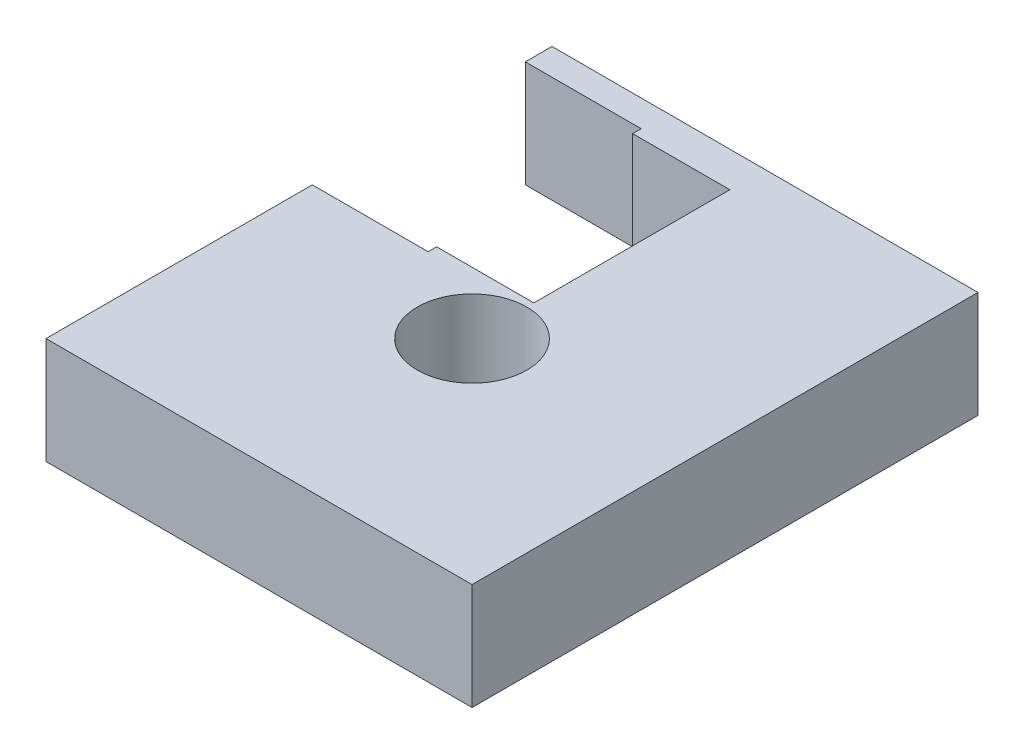
ISO-10303-21;
HEADER;
FILE_DESCRIPTION(('STEP AP214'),'2;1');
FILE_NAME('part.step','',(''),(''),'','','');
FILE_SCHEMA(('AUTOMOTIVE_DESIGN { 1 0 10303 214 1 1 1 1 }'));
ENDSEC;
DATA;
#1=APPLICATION_CONTEXT('core data for automotive mechanical design processes');
#2=APPLICATION_PROTOCOL_DEFINITION('international standard','automotive_design',2000,#1);
#3=PRODUCT_CONTEXT('',#1,'mechanical');
#4=PRODUCT('Part','Part','',(#3));
#5=PRODUCT_RELATED_PRODUCT_CATEGORY('part','',(#4));
#6=PRODUCT_DEFINITION_FORMATION('','',#4);
#7=PRODUCT_DEFINITION_CONTEXT('part definition',#1,'design');
#8=PRODUCT_DEFINITION('design','',#6,#7);
#9=PRODUCT_DEFINITION_SHAPE('','',#8);
#10=(LENGTH_UNIT() NAMED_UNIT(*) SI_UNIT(.MILLI.,.METRE.));
#11=(NAMED_UNIT(*) PLANE_ANGLE_UNIT() SI_UNIT($,.RADIAN.));
#12=(NAMED_UNIT(*) SI_UNIT($,.STERADIAN.) SOLID_ANGLE_UNIT());
#13=UNCERTAINTY_MEASURE_WITH_UNIT(LENGTH_MEASURE(1.E-05),#10,'distance_accuracy_value','');
#14=(GEOMETRIC_REPRESENTATION_CONTEXT(3) GLOBAL_UNCERTAINTY_ASSIGNED_CONTEXT((#13)) GLOBAL_UNIT_ASSIGNED_CONTEXT((#10,
#11,#12)) REPRESENTATION_CONTEXT('',''));
#15=CARTESIAN_POINT('',(0.,0.,0.));
#16=DIRECTION('',(0.,0.,1.));
#17=DIRECTION('',(1.,0.,0.));
#18=AXIS2_PLACEMENT_3D('',#15,#16,#17);
#19=CARTESIAN_POINT('',(0.,6.35,0.));
#20=DIRECTION('',(0.,-1.,0.));
#21=DIRECTION('',(0.,0.,-1.));
#22=AXIS2_PLACEMENT_3D('',#19,#20,#21);
#23=PLANE('',#22);
#24=DIRECTION('',(1.,0.,0.));
#25=VECTOR('',#24,1.);
#26=CARTESIAN_POINT('',(-12.7,6.35,-15.875));
#27=LINE('',#26,#25);
#28=CARTESIAN_POINT('',(-12.7,6.35,-15.875));
#29=VERTEX_POINT('',#28);
#30=CARTESIAN_POINT('',(-5.7912,6.35,-15.875));
#31=VERTEX_POINT('',#30);
#32=EDGE_CURVE('E179',#29,#31,#27,.T.);
#33=ORIENTED_EDGE('',*,*,#32,.T.);
#34=DIRECTION('',(0.,0.,1.));
#35=VECTOR('',#34,1.);
#36=CARTESIAN_POINT('',(-5.7912,6.35,-15.875));
#37=LINE('',#36,#35);
#38=CARTESIAN_POINT('',(-5.7912,6.35,-15.367));
#39=VERTEX_POINT('',#38);
#40=EDGE_CURVE('E107',#31,#39,#37,.T.);
#41=ORIENTED_EDGE('',*,*,#40,.T.);
#42=DIRECTION('',(1.,0.,0.));
#43=VECTOR('',#42,1.);
#44=CARTESIAN_POINT('',(-5.7912,6.35,-15.367));
#45=LINE('',#44,#43);
#46=CARTESIAN_POINT('',(0.,6.35,-15.367));
#47=VERTEX_POINT('',#46);
#48=EDGE_CURVE('E206',#39,#47,#45,.T.);
#49=ORIENTED_EDGE('',*,*,#48,.T.);
#50=DIRECTION('',(0.,0.,1.));
#51=VECTOR('',#50,1.);
#52=CARTESIAN_POINT('',(0.,6.35,-3.683));
#53=LINE('',#52,#51);
#54=CARTESIAN_POINT('',(0.,6.35,-3.683));
#55=VERTEX_POINT('',#54);
#56=EDGE_CURVE('E224',#47,#55,#53,.T.);
#57=ORIENTED_EDGE('',*,*,#56,.T.);
#58=DIRECTION('',(-1.,0.,0.));
#59=VECTOR('',#58,1.);
#60=CARTESIAN_POINT('',(-5.7912,6.35,-3.683));
#61=LINE('',#60,#59);
#62=CARTESIAN_POINT('',(-5.7912,6.35,-3.683));
#63=VERTEX_POINT('',#62);
#64=EDGE_CURVE('E221',#55,#63,#61,.T.);
#65=ORIENTED_EDGE('',*,*,#64,.T.);
#66=DIRECTION('',(0.,0.,1.));
#67=VECTOR('',#66,1.);
#68=CARTESIAN_POINT('',(-5.7912,6.35,-3.175));
#69=LINE('',#68,#67);
#70=CARTESIAN_POINT('',(-5.7912,6.35,-3.175));
#71=VERTEX_POINT('',#70);
#72=EDGE_CURVE('E223',#63,#71,#69,.T.);
#73=ORIENTED_EDGE('',*,*,#72,.T.);
#74=DIRECTION('',(-1.,0.,0.));
#75=VECTOR('',#74,1.);
#76=CARTESIAN_POINT('',(-12.7,6.35,-3.175));
#77=LINE('',#76,#75);
#78=CARTESIAN_POINT('',(-12.7,6.35,-3.175));
#79=VERTEX_POINT('',#78);
#80=EDGE_CURVE('E226',#71,#79,#77,.T.);
#81=ORIENTED_EDGE('',*,*,#80,.T.);
#82=DIRECTION('',(0.,0.,1.));
#83=VECTOR('',#82,1.);
#84=CARTESIAN_POINT('',(-12.7,6.35,12.7));
#85=LINE('',#84,#83);
#86=CARTESIAN_POINT('',(-12.7,6.35,12.7));
#87=VERTEX_POINT('',#86);
#88=EDGE_CURVE('E232',#79,#87,#85,.T.);
#89=ORIENTED_EDGE('',*,*,#88,.T.);
#90=DIRECTION('',(1.,0.,0.));
#91=VECTOR('',#90,1.);
#92=CARTESIAN_POINT('',(12.7,6.35,12.7));
#93=LINE('',#92,#91);
#94=CARTESIAN_POINT('',(12.7,6.35,12.7));
#95=VERTEX_POINT('',#94);
#96=EDGE_CURVE('E138',#87,#95,#93,.T.);
#97=ORIENTED_EDGE('',*,*,#96,.T.);
#98=DIRECTION('',(0.,0.,-1.));
#99=VECTOR('',#98,1.);
#100=CARTESIAN_POINT('',(12.7,6.35,-17.4625));
#101=LINE('',#100,#99);
#102=CARTESIAN_POINT('',(12.7,6.35,-17.4625));
#103=VERTEX_POINT('',#102);
#104=EDGE_CURVE('E132',#95,#103,#101,.T.);
#105=ORIENTED_EDGE('',*,*,#104,.T.);
#106=DIRECTION('',(-1.,0.,0.));
#107=VECTOR('',#106,1.);
#108=CARTESIAN_POINT('',(-12.7,6.35,-17.4625));
#109=LINE('',#108,#107);
#110=CARTESIAN_POINT('',(-12.7,6.35,-17.4625));
#111=VERTEX_POINT('',#110);
#112=EDGE_CURVE('E136',#103,#111,#109,.T.);
#113=ORIENTED_EDGE('',*,*,#112,.T.);
#114=DIRECTION('',(0.,0.,1.));
#115=VECTOR('',#114,1.);
#116=CARTESIAN_POINT('',(-12.7,6.35,-15.875));
#117=LINE('',#116,#115);
#118=EDGE_CURVE('E52',#111,#29,#117,.T.);
#119=ORIENTED_EDGE('',*,*,#118,.T.);
#120=EDGE_LOOP('',(#33,#41,#49,#57,#65,#73,#81,#89,#97,#105,#113,#119));
#121=FACE_BOUND('',#120,.T.);
#122=CARTESIAN_POINT('',(0.,6.35,0.));
#123=DIRECTION('',(0.,1.,0.));
#124=DIRECTION('',(0.,0.,1.));
#125=AXIS2_PLACEMENT_3D('',#122,#123,#124);
#126=CIRCLE('',#125,3.2639);
#127=CARTESIAN_POINT('',(0.,6.35,3.2639));
#128=VERTEX_POINT('',#127);
#129=EDGE_CURVE('E273',#128,#128,#126,.T.);
#130=ORIENTED_EDGE('',*,*,#129,.F.);
#131=EDGE_LOOP('',(#130));
#132=FACE_BOUND('',#131,.T.);
#133=ADVANCED_FACE('F35',(#121,#132),#23,.F.);
#134=CARTESIAN_POINT('',(-12.7,6.35,-15.875));
#135=DIRECTION('',(0.,0.,-1.));
#136=DIRECTION('',(-1.,0.,0.));
#137=AXIS2_PLACEMENT_3D('',#134,#135,#136);
#138=PLANE('',#137);
#139=DIRECTION('',(1.,0.,0.));
#140=VECTOR('',#139,1.);
#141=CARTESIAN_POINT('',(-12.7,0.,-15.875));
#142=LINE('',#141,#140);
#143=CARTESIAN_POINT('',(-12.7,0.,-15.875));
#144=VERTEX_POINT('',#143);
#145=CARTESIAN_POINT('',(-5.7912,0.,-15.875));
#146=VERTEX_POINT('',#145);
#147=EDGE_CURVE('E156',#144,#146,#142,.T.);
#148=ORIENTED_EDGE('',*,*,#147,.T.);
#149=DIRECTION('',(0.,-1.,0.));
#150=VECTOR('',#149,1.);
#151=CARTESIAN_POINT('',(-5.7912,6.35,-15.875));
#152=LINE('',#151,#150);
#153=EDGE_CURVE('E11',#31,#146,#152,.T.);
#154=ORIENTED_EDGE('',*,*,#153,.F.);
#155=ORIENTED_EDGE('',*,*,#32,.F.);
#156=DIRECTION('',(0.,-1.,0.));
#157=VECTOR('',#156,1.);
#158=CARTESIAN_POINT('',(-12.7,6.35,-15.875));
#159=LINE('',#158,#157);
#160=EDGE_CURVE('E152',#29,#144,#159,.T.);
#161=ORIENTED_EDGE('',*,*,#160,.T.);
#162=EDGE_LOOP('',(#148,#154,#155,#161));
#163=FACE_BOUND('',#162,.T.);
#164=ADVANCED_FACE('F37',(#163),#138,.F.);
#165=CARTESIAN_POINT('',(-5.7912,6.35,-15.875));
#166=DIRECTION('',(1.,0.,0.));
#167=DIRECTION('',(0.,0.,-1.));
#168=AXIS2_PLACEMENT_3D('',#165,#166,#167);
#169=PLANE('',#168);
#170=DIRECTION('',(0.,0.,1.));
#171=VECTOR('',#170,1.);
#172=CARTESIAN_POINT('',(-5.7912,0.,-15.875));
#173=LINE('',#172,#171);
#174=CARTESIAN_POINT('',(-5.7912,0.,-15.367));
#175=VERTEX_POINT('',#174);
#176=EDGE_CURVE('E159',#146,#175,#173,.T.);
#177=ORIENTED_EDGE('',*,*,#176,.T.);
#178=DIRECTION('',(0.,-1.,0.));
#179=VECTOR('',#178,1.);
#180=CARTESIAN_POINT('',(-5.7912,6.35,-15.367));
#181=LINE('',#180,#179);
#182=EDGE_CURVE('E44',#39,#175,#181,.T.);
#183=ORIENTED_EDGE('',*,*,#182,.F.);
#184=ORIENTED_EDGE('',*,*,#40,.F.);
#185=ORIENTED_EDGE('',*,*,#153,.T.);
#186=EDGE_LOOP('',(#177,#183,#184,#185));
#187=FACE_BOUND('',#186,.T.);
#188=ADVANCED_FACE('F262',(#187),#169,.F.);
#189=CARTESIAN_POINT('',(-5.7912,6.35,-15.367));
#190=DIRECTION('',(0.,0.,-1.));
#191=DIRECTION('',(-1.,0.,0.));
#192=AXIS2_PLACEMENT_3D('',#189,#190,#191);
#193=PLANE('',#192);
#194=DIRECTION('',(1.,0.,0.));
#195=VECTOR('',#194,1.);
#196=CARTESIAN_POINT('',(-5.7912,0.,-15.367));
#197=LINE('',#196,#195);
#198=CARTESIAN_POINT('',(0.,0.,-15.367));
#199=VERTEX_POINT('',#198);
#200=EDGE_CURVE('E162',#175,#199,#197,.T.);
#201=ORIENTED_EDGE('',*,*,#200,.T.);
#202=DIRECTION('',(0.,-1.,0.));
#203=VECTOR('',#202,1.);
#204=CARTESIAN_POINT('',(0.,6.35,-15.367));
#205=LINE('',#204,#203);
#206=EDGE_CURVE('E198',#47,#199,#205,.T.);
#207=ORIENTED_EDGE('',*,*,#206,.F.);
#208=ORIENTED_EDGE('',*,*,#48,.F.);
#209=ORIENTED_EDGE('',*,*,#182,.T.);
#210=EDGE_LOOP('',(#201,#207,#208,#209));
#211=FACE_BOUND('',#210,.T.);
#212=ADVANCED_FACE('F204',(#211),#193,.F.);
#213=CARTESIAN_POINT('',(0.,6.35,-3.683));
#214=DIRECTION('',(1.,0.,0.));
#215=DIRECTION('',(0.,0.,-1.));
#216=AXIS2_PLACEMENT_3D('',#213,#214,#215);
#217=PLANE('',#216);
#218=DIRECTION('',(0.,0.,1.));
#219=VECTOR('',#218,1.);
#220=CARTESIAN_POINT('',(0.,0.,-3.683));
#221=LINE('',#220,#219);
#222=CARTESIAN_POINT('',(0.,0.,-3.683));
#223=VERTEX_POINT('',#222);
#224=EDGE_CURVE('E164',#199,#223,#221,.T.);
#225=ORIENTED_EDGE('',*,*,#224,.T.);
#226=DIRECTION('',(0.,-1.,0.));
#227=VECTOR('',#226,1.);
#228=CARTESIAN_POINT('',(0.,6.35,-3.683));
#229=LINE('',#228,#227);
#230=EDGE_CURVE('E195',#55,#223,#229,.T.);
#231=ORIENTED_EDGE('',*,*,#230,.F.);
#232=ORIENTED_EDGE('',*,*,#56,.F.);
#233=ORIENTED_EDGE('',*,*,#206,.T.);
#234=EDGE_LOOP('',(#225,#231,#232,#233));
#235=FACE_BOUND('',#234,.T.);
#236=ADVANCED_FACE('F215',(#235),#217,.F.);
#237=CARTESIAN_POINT('',(-5.7912,6.35,-3.683));
#238=DIRECTION('',(0.,0.,1.));
#239=DIRECTION('',(1.,0.,0.));
#240=AXIS2_PLACEMENT_3D('',#237,#238,#239);
#241=PLANE('',#240);
#242=DIRECTION('',(-1.,0.,0.));
#243=VECTOR('',#242,1.);
#244=CARTESIAN_POINT('',(-5.7912,0.,-3.683));
#245=LINE('',#244,#243);
#246=CARTESIAN_POINT('',(-5.7912,0.,-3.683));
#247=VERTEX_POINT('',#246);
#248=EDGE_CURVE('E166',#223,#247,#245,.T.);
#249=ORIENTED_EDGE('',*,*,#248,.T.);
#250=DIRECTION('',(0.,-1.,0.));
#251=VECTOR('',#250,1.);
#252=CARTESIAN_POINT('',(-5.7912,6.35,-3.683));
#253=LINE('',#252,#251);
#254=EDGE_CURVE('E192',#63,#247,#253,.T.);
#255=ORIENTED_EDGE('',*,*,#254,.F.);
#256=ORIENTED_EDGE('',*,*,#64,.F.);
#257=ORIENTED_EDGE('',*,*,#230,.T.);
#258=EDGE_LOOP('',(#249,#255,#256,#257));
#259=FACE_BOUND('',#258,.T.);
#260=ADVANCED_FACE('F219',(#259),#241,.F.);
#261=CARTESIAN_POINT('',(-5.7912,6.35,-3.175));
#262=DIRECTION('',(1.,0.,0.));
#263=DIRECTION('',(0.,0.,-1.));
#264=AXIS2_PLACEMENT_3D('',#261,#262,#263);
#265=PLANE('',#264);
#266=DIRECTION('',(0.,0.,1.));
#267=VECTOR('',#266,1.);
#268=CARTESIAN_POINT('',(-5.7912,0.,-3.175));
#269=LINE('',#268,#267);
#270=CARTESIAN_POINT('',(-5.7912,0.,-3.175));
#271=VERTEX_POINT('',#270);
#272=EDGE_CURVE('E168',#247,#271,#269,.T.);
#273=ORIENTED_EDGE('',*,*,#272,.T.);
#274=DIRECTION('',(0.,-1.,0.));
#275=VECTOR('',#274,1.);
#276=CARTESIAN_POINT('',(-5.7912,6.35,-3.175));
#277=LINE('',#276,#275);
#278=EDGE_CURVE('E189',#71,#271,#277,.T.);
#279=ORIENTED_EDGE('',*,*,#278,.F.);
#280=ORIENTED_EDGE('',*,*,#72,.F.);
#281=ORIENTED_EDGE('',*,*,#254,.T.);
#282=EDGE_LOOP('',(#273,#279,#280,#281));
#283=FACE_BOUND('',#282,.T.);
#284=ADVANCED_FACE('F330',(#283),#265,.F.);
#285=CARTESIAN_POINT('',(-12.7,6.35,-3.175));
#286=DIRECTION('',(0.,0.,1.));
#287=DIRECTION('',(1.,0.,0.));
#288=AXIS2_PLACEMENT_3D('',#285,#286,#287);
#289=PLANE('',#288);
#290=DIRECTION('',(-1.,0.,0.));
#291=VECTOR('',#290,1.);
#292=CARTESIAN_POINT('',(-12.7,0.,-3.175));
#293=LINE('',#292,#291);
#294=CARTESIAN_POINT('',(-12.7,0.,-3.175));
#295=VERTEX_POINT('',#294);
#296=EDGE_CURVE('E170',#271,#295,#293,.T.);
#297=ORIENTED_EDGE('',*,*,#296,.T.);
#298=DIRECTION('',(0.,-1.,0.));
#299=VECTOR('',#298,1.);
#300=CARTESIAN_POINT('',(-12.7,6.35,-3.175));
#301=LINE('',#300,#299);
#302=EDGE_CURVE('E186',#79,#295,#301,.T.);
#303=ORIENTED_EDGE('',*,*,#302,.F.);
#304=ORIENTED_EDGE('',*,*,#80,.F.);
#305=ORIENTED_EDGE('',*,*,#278,.T.);
#306=EDGE_LOOP('',(#297,#303,#304,#305));
#307=FACE_BOUND('',#306,.T.);
#308=ADVANCED_FACE('F321',(#307),#289,.F.);
#309=CARTESIAN_POINT('',(-12.7,6.35,12.7));
#310=DIRECTION('',(1.,0.,0.));
#311=DIRECTION('',(0.,0.,-1.));
#312=AXIS2_PLACEMENT_3D('',#309,#310,#311);
#313=PLANE('',#312);
#314=DIRECTION('',(0.,0.,1.));
#315=VECTOR('',#314,1.);
#316=CARTESIAN_POINT('',(-12.7,0.,12.7));
#317=LINE('',#316,#315);
#318=CARTESIAN_POINT('',(-12.7,0.,12.7));
#319=VERTEX_POINT('',#318);
#320=EDGE_CURVE('E172',#295,#319,#317,.T.);
#321=ORIENTED_EDGE('',*,*,#320,.T.);
#322=DIRECTION('',(0.,-1.,0.));
#323=VECTOR('',#322,1.);
#324=CARTESIAN_POINT('',(-12.7,6.35,12.7));
#325=LINE('',#324,#323);
#326=EDGE_CURVE('E183',#87,#319,#325,.T.);
#327=ORIENTED_EDGE('',*,*,#326,.F.);
#328=ORIENTED_EDGE('',*,*,#88,.F.);
#329=ORIENTED_EDGE('',*,*,#302,.T.);
#330=EDGE_LOOP('',(#321,#327,#328,#329));
#331=FACE_BOUND('',#330,.T.);
#332=ADVANCED_FACE('F238',(#331),#313,.F.);
#333=CARTESIAN_POINT('',(12.7,6.35,12.7));
#334=DIRECTION('',(0.,0.,-1.));
#335=DIRECTION('',(-1.,0.,0.));
#336=AXIS2_PLACEMENT_3D('',#333,#334,#335);
#337=PLANE('',#336);
#338=DIRECTION('',(1.,0.,0.));
#339=VECTOR('',#338,1.);
#340=CARTESIAN_POINT('',(12.7,0.,12.7));
#341=LINE('',#340,#339);
#342=CARTESIAN_POINT('',(12.7,0.,12.7));
#343=VERTEX_POINT('',#342);
#344=EDGE_CURVE('E174',#319,#343,#341,.T.);
#345=ORIENTED_EDGE('',*,*,#344,.T.);
#346=DIRECTION('',(0.,-1.,0.));
#347=VECTOR('',#346,1.);
#348=CARTESIAN_POINT('',(12.7,6.35,12.7));
#349=LINE('',#348,#347);
#350=EDGE_CURVE('E147',#95,#343,#349,.T.);
#351=ORIENTED_EDGE('',*,*,#350,.F.);
#352=ORIENTED_EDGE('',*,*,#96,.F.);
#353=ORIENTED_EDGE('',*,*,#326,.T.);
#354=EDGE_LOOP('',(#345,#351,#352,#353));
#355=FACE_BOUND('',#354,.T.);
#356=ADVANCED_FACE('F242',(#355),#337,.F.);
#357=CARTESIAN_POINT('',(12.7,6.35,-17.4625));
#358=DIRECTION('',(-1.,0.,0.));
#359=DIRECTION('',(0.,0.,1.));
#360=AXIS2_PLACEMENT_3D('',#357,#358,#359);
#361=PLANE('',#360);
#362=DIRECTION('',(0.,0.,-1.));
#363=VECTOR('',#362,1.);
#364=CARTESIAN_POINT('',(12.7,0.,-17.4625));
#365=LINE('',#364,#363);
#366=CARTESIAN_POINT('',(12.7,0.,-17.4625));
#367=VERTEX_POINT('',#366);
#368=EDGE_CURVE('E146',#343,#367,#365,.T.);
#369=ORIENTED_EDGE('',*,*,#368,.T.);
#370=DIRECTION('',(0.,-1.,0.));
#371=VECTOR('',#370,1.);
#372=CARTESIAN_POINT('',(12.7,6.35,-17.4625));
#373=LINE('',#372,#371);
#374=EDGE_CURVE('E143',#103,#367,#373,.T.);
#375=ORIENTED_EDGE('',*,*,#374,.F.);
#376=ORIENTED_EDGE('',*,*,#104,.F.);
#377=ORIENTED_EDGE('',*,*,#350,.T.);
#378=EDGE_LOOP('',(#369,#375,#376,#377));
#379=FACE_BOUND('',#378,.T.);
#380=ADVANCED_FACE('F144',(#379),#361,.F.);
#381=CARTESIAN_POINT('',(-12.7,6.35,-17.4625));
#382=DIRECTION('',(0.,0.,1.));
#383=DIRECTION('',(1.,0.,0.));
#384=AXIS2_PLACEMENT_3D('',#381,#382,#383);
#385=PLANE('',#384);
#386=DIRECTION('',(-1.,0.,0.));
#387=VECTOR('',#386,1.);
#388=CARTESIAN_POINT('',(-12.7,0.,-17.4625));
#389=LINE('',#388,#387);
#390=CARTESIAN_POINT('',(-12.7,0.,-17.4625));
#391=VERTEX_POINT('',#390);
#392=EDGE_CURVE('E93',#367,#391,#389,.T.);
#393=ORIENTED_EDGE('',*,*,#392,.T.);
#394=DIRECTION('',(0.,-1.,0.));
#395=VECTOR('',#394,1.);
#396=CARTESIAN_POINT('',(-12.7,6.35,-17.4625));
#397=LINE('',#396,#395);
#398=EDGE_CURVE('E148',#111,#391,#397,.T.);
#399=ORIENTED_EDGE('',*,*,#398,.F.);
#400=ORIENTED_EDGE('',*,*,#112,.F.);
#401=ORIENTED_EDGE('',*,*,#374,.T.);
#402=EDGE_LOOP('',(#393,#399,#400,#401));
#403=FACE_BOUND('',#402,.T.);
#404=ADVANCED_FACE('F150',(#403),#385,.F.);
#405=CARTESIAN_POINT('',(-12.7,6.35,-15.875));
#406=DIRECTION('',(1.,0.,0.));
#407=DIRECTION('',(0.,0.,-1.));
#408=AXIS2_PLACEMENT_3D('',#405,#406,#407);
#409=PLANE('',#408);
#410=DIRECTION('',(0.,0.,1.));
#411=VECTOR('',#410,1.);
#412=CARTESIAN_POINT('',(-12.7,0.,-15.875));
#413=LINE('',#412,#411);
#414=EDGE_CURVE('E99',#391,#144,#413,.T.);
#415=ORIENTED_EDGE('',*,*,#414,.T.);
#416=ORIENTED_EDGE('',*,*,#160,.F.);
#417=ORIENTED_EDGE('',*,*,#118,.F.);
#418=ORIENTED_EDGE('',*,*,#398,.T.);
#419=EDGE_LOOP('',(#415,#416,#417,#418));
#420=FACE_BOUND('',#419,.T.);
#421=ADVANCED_FACE('F246',(#420),#409,.F.);
#422=CARTESIAN_POINT('',(0.,0.,0.));
#423=DIRECTION('',(0.,-1.,0.));
#424=DIRECTION('',(0.,0.,-1.));
#425=AXIS2_PLACEMENT_3D('',#422,#423,#424);
#426=PLANE('',#425);
#427=CARTESIAN_POINT('',(0.,0.,0.));
#428=DIRECTION('',(0.,1.,0.));
#429=DIRECTION('',(0.,0.,1.));
#430=AXIS2_PLACEMENT_3D('',#427,#428,#429);
#431=CIRCLE('',#430,3.2639);
#432=CARTESIAN_POINT('',(0.,0.,3.2639));
#433=VERTEX_POINT('',#432);
#434=EDGE_CURVE('E160',#433,#433,#431,.T.);
#435=ORIENTED_EDGE('',*,*,#434,.T.);
#436=EDGE_LOOP('',(#435));
#437=FACE_BOUND('',#436,.T.);
#438=ORIENTED_EDGE('',*,*,#147,.F.);
#439=ORIENTED_EDGE('',*,*,#414,.F.);
#440=ORIENTED_EDGE('',*,*,#392,.F.);
#441=ORIENTED_EDGE('',*,*,#368,.F.);
#442=ORIENTED_EDGE('',*,*,#344,.F.);
#443=ORIENTED_EDGE('',*,*,#320,.F.);
#444=ORIENTED_EDGE('',*,*,#296,.F.);
#445=ORIENTED_EDGE('',*,*,#272,.F.);
#446=ORIENTED_EDGE('',*,*,#248,.F.);
#447=ORIENTED_EDGE('',*,*,#224,.F.);
#448=ORIENTED_EDGE('',*,*,#200,.F.);
#449=ORIENTED_EDGE('',*,*,#176,.F.);
#450=EDGE_LOOP('',(#438,#439,#440,#441,#442,#443,#444,#445,#446,#447,#448,#449));
#451=FACE_BOUND('',#450,.T.);
#452=ADVANCED_FACE('F210',(#437,#451),#426,.T.);
#453=CARTESIAN_POINT('',(0.,6.35,0.));
#454=DIRECTION('',(0.,1.,0.));
#455=DIRECTION('',(0.,0.,1.));
#456=AXIS2_PLACEMENT_3D('',#453,#454,#455);
#457=CYLINDRICAL_SURFACE('',#456,3.2639);
#458=ORIENTED_EDGE('',*,*,#434,.F.);
#459=EDGE_LOOP('',(#458));
#460=FACE_BOUND('',#459,.T.);
#461=ORIENTED_EDGE('',*,*,#129,.T.);
#462=EDGE_LOOP('',(#461));
#463=FACE_BOUND('',#462,.T.);
#464=ADVANCED_FACE('F253',(#460,#463),#457,.F.);
#465=CLOSED_SHELL('',(#133,#164,#188,#212,#236,#260,#284,#308,#332,#356,#380,#404,#421,#452,#464));
#466=MANIFOLD_SOLID_BREP('B2',#465);
#467=ADVANCED_BREP_SHAPE_REPRESENTATION('',(#18,#466),#14);
#468=SHAPE_DEFINITION_REPRESENTATION(#9,#467);
ENDSEC;
END-ISO-10303-21;
